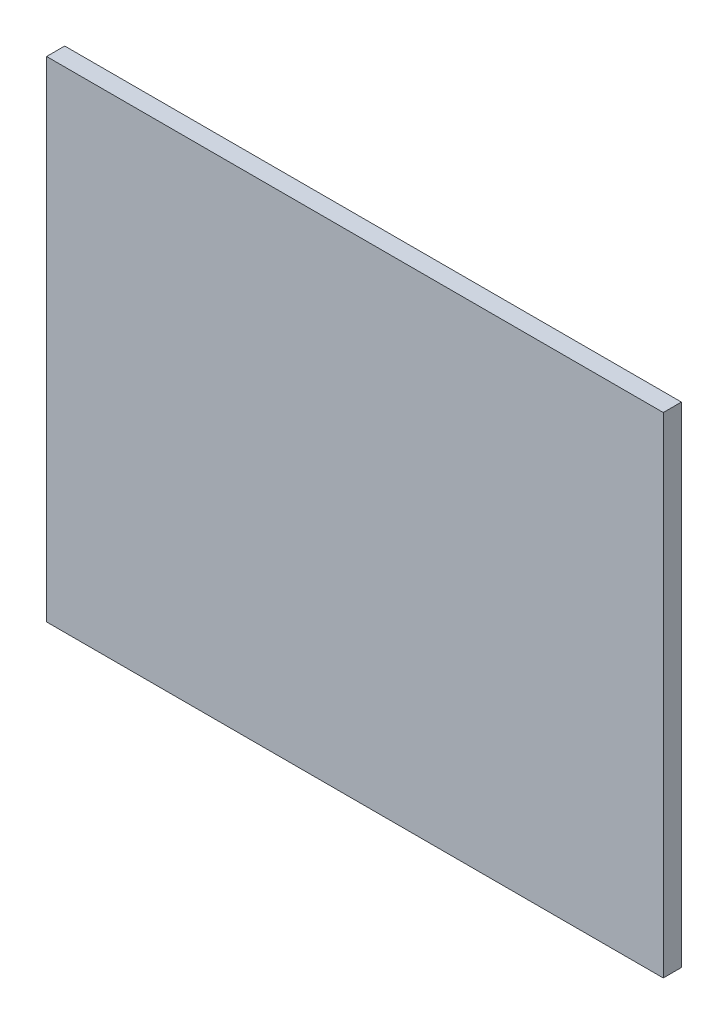
ISO-10303-21;
HEADER;
FILE_DESCRIPTION(('STEP AP214'),'2;1');
FILE_NAME('part.step','',(''),(''),'','','');
FILE_SCHEMA(('AUTOMOTIVE_DESIGN { 1 0 10303 214 1 1 1 1 }'));
ENDSEC;
DATA;
#1=APPLICATION_CONTEXT('core data for automotive mechanical design processes');
#2=APPLICATION_PROTOCOL_DEFINITION('international standard','automotive_design',2000,#1);
#3=PRODUCT_CONTEXT('',#1,'mechanical');
#4=PRODUCT('Part','Part','',(#3));
#5=PRODUCT_RELATED_PRODUCT_CATEGORY('part','',(#4));
#6=PRODUCT_DEFINITION_FORMATION('','',#4);
#7=PRODUCT_DEFINITION_CONTEXT('part definition',#1,'design');
#8=PRODUCT_DEFINITION('design','',#6,#7);
#9=PRODUCT_DEFINITION_SHAPE('','',#8);
#10=(LENGTH_UNIT() NAMED_UNIT(*) SI_UNIT(.MILLI.,.METRE.));
#11=(NAMED_UNIT(*) PLANE_ANGLE_UNIT() SI_UNIT($,.RADIAN.));
#12=(NAMED_UNIT(*) SI_UNIT($,.STERADIAN.) SOLID_ANGLE_UNIT());
#13=UNCERTAINTY_MEASURE_WITH_UNIT(LENGTH_MEASURE(1.E-05),#10,'distance_accuracy_value','');
#14=(GEOMETRIC_REPRESENTATION_CONTEXT(3) GLOBAL_UNCERTAINTY_ASSIGNED_CONTEXT((#13)) GLOBAL_UNIT_ASSIGNED_CONTEXT((#10,
#11,#12)) REPRESENTATION_CONTEXT('',''));
#15=CARTESIAN_POINT('',(0.,0.,0.));
#16=DIRECTION('',(0.,0.,1.));
#17=DIRECTION('',(1.,0.,0.));
#18=AXIS2_PLACEMENT_3D('',#15,#16,#17);
#19=CARTESIAN_POINT('',(340.,270.,10.));
#20=DIRECTION('',(-1.,0.,0.));
#21=DIRECTION('',(0.,-1.,0.));
#22=AXIS2_PLACEMENT_3D('',#19,#20,#21);
#23=PLANE('',#22);
#24=DIRECTION('',(0.,1.,0.));
#25=VECTOR('',#24,1.);
#26=CARTESIAN_POINT('',(340.,270.,0.));
#27=LINE('',#26,#25);
#28=CARTESIAN_POINT('',(340.,0.,0.));
#29=VERTEX_POINT('',#28);
#30=CARTESIAN_POINT('',(340.,270.,0.));
#31=VERTEX_POINT('',#30);
#32=EDGE_CURVE('E96',#29,#31,#27,.T.);
#33=ORIENTED_EDGE('',*,*,#32,.T.);
#34=DIRECTION('',(0.,0.,-1.));
#35=VECTOR('',#34,1.);
#36=CARTESIAN_POINT('',(340.,270.,10.));
#37=LINE('',#36,#35);
#38=CARTESIAN_POINT('',(340.,270.,10.));
#39=VERTEX_POINT('',#38);
#40=EDGE_CURVE('E11',#39,#31,#37,.T.);
#41=ORIENTED_EDGE('',*,*,#40,.F.);
#42=DIRECTION('',(0.,1.,0.));
#43=VECTOR('',#42,1.);
#44=CARTESIAN_POINT('',(340.,270.,10.));
#45=LINE('',#44,#43);
#46=CARTESIAN_POINT('',(340.,0.,10.));
#47=VERTEX_POINT('',#46);
#48=EDGE_CURVE('E84',#47,#39,#45,.T.);
#49=ORIENTED_EDGE('',*,*,#48,.F.);
#50=DIRECTION('',(0.,0.,-1.));
#51=VECTOR('',#50,1.);
#52=CARTESIAN_POINT('',(340.,0.,10.));
#53=LINE('',#52,#51);
#54=EDGE_CURVE('E92',#47,#29,#53,.T.);
#55=ORIENTED_EDGE('',*,*,#54,.T.);
#56=EDGE_LOOP('',(#33,#41,#49,#55));
#57=FACE_BOUND('',#56,.T.);
#58=ADVANCED_FACE('F33',(#57),#23,.F.);
#59=CARTESIAN_POINT('',(340.,270.,10.));
#60=DIRECTION('',(0.,-1.,0.));
#61=DIRECTION('',(1.,0.,0.));
#62=AXIS2_PLACEMENT_3D('',#59,#60,#61);
#63=PLANE('',#62);
#64=DIRECTION('',(-1.,0.,0.));
#65=VECTOR('',#64,1.);
#66=CARTESIAN_POINT('',(340.,270.,0.));
#67=LINE('',#66,#65);
#68=CARTESIAN_POINT('',(2.22044604925031E-13,270.,0.));
#69=VERTEX_POINT('',#68);
#70=EDGE_CURVE('E88',#31,#69,#67,.T.);
#71=ORIENTED_EDGE('',*,*,#70,.T.);
#72=DIRECTION('',(0.,0.,-1.));
#73=VECTOR('',#72,1.);
#74=CARTESIAN_POINT('',(2.22044604925031E-13,270.,10.));
#75=LINE('',#74,#73);
#76=CARTESIAN_POINT('',(2.22044604925031E-13,270.,10.));
#77=VERTEX_POINT('',#76);
#78=EDGE_CURVE('E41',#77,#69,#75,.T.);
#79=ORIENTED_EDGE('',*,*,#78,.F.);
#80=DIRECTION('',(-1.,0.,0.));
#81=VECTOR('',#80,1.);
#82=CARTESIAN_POINT('',(340.,270.,10.));
#83=LINE('',#82,#81);
#84=EDGE_CURVE('E79',#39,#77,#83,.T.);
#85=ORIENTED_EDGE('',*,*,#84,.F.);
#86=ORIENTED_EDGE('',*,*,#40,.T.);
#87=EDGE_LOOP('',(#71,#79,#85,#86));
#88=FACE_BOUND('',#87,.T.);
#89=ADVANCED_FACE('F87',(#88),#63,.F.);
#90=CARTESIAN_POINT('',(2.22044604925031E-13,270.,10.));
#91=DIRECTION('',(1.,0.,0.));
#92=DIRECTION('',(0.,1.,0.));
#93=AXIS2_PLACEMENT_3D('',#90,#91,#92);
#94=PLANE('',#93);
#95=DIRECTION('',(0.,-1.,0.));
#96=VECTOR('',#95,1.);
#97=CARTESIAN_POINT('',(2.22044604925031E-13,270.,0.));
#98=LINE('',#97,#96);
#99=CARTESIAN_POINT('',(0.,0.,0.));
#100=VERTEX_POINT('',#99);
#101=EDGE_CURVE('E66',#69,#100,#98,.T.);
#102=ORIENTED_EDGE('',*,*,#101,.T.);
#103=DIRECTION('',(0.,0.,-1.));
#104=VECTOR('',#103,1.);
#105=CARTESIAN_POINT('',(0.,0.,10.));
#106=LINE('',#105,#104);
#107=CARTESIAN_POINT('',(0.,0.,10.));
#108=VERTEX_POINT('',#107);
#109=EDGE_CURVE('E89',#108,#100,#106,.T.);
#110=ORIENTED_EDGE('',*,*,#109,.F.);
#111=DIRECTION('',(0.,-1.,0.));
#112=VECTOR('',#111,1.);
#113=CARTESIAN_POINT('',(2.22044604925031E-13,270.,10.));
#114=LINE('',#113,#112);
#115=EDGE_CURVE('E82',#77,#108,#114,.T.);
#116=ORIENTED_EDGE('',*,*,#115,.F.);
#117=ORIENTED_EDGE('',*,*,#78,.T.);
#118=EDGE_LOOP('',(#102,#110,#116,#117));
#119=FACE_BOUND('',#118,.T.);
#120=ADVANCED_FACE('F90',(#119),#94,.F.);
#121=CARTESIAN_POINT('',(340.,0.,10.));
#122=DIRECTION('',(0.,1.,0.));
#123=DIRECTION('',(-1.,0.,0.));
#124=AXIS2_PLACEMENT_3D('',#121,#122,#123);
#125=PLANE('',#124);
#126=DIRECTION('',(1.,0.,0.));
#127=VECTOR('',#126,1.);
#128=CARTESIAN_POINT('',(340.,0.,0.));
#129=LINE('',#128,#127);
#130=EDGE_CURVE('E72',#100,#29,#129,.T.);
#131=ORIENTED_EDGE('',*,*,#130,.T.);
#132=ORIENTED_EDGE('',*,*,#54,.F.);
#133=DIRECTION('',(1.,0.,0.));
#134=VECTOR('',#133,1.);
#135=CARTESIAN_POINT('',(340.,0.,10.));
#136=LINE('',#135,#134);
#137=EDGE_CURVE('E49',#108,#47,#136,.T.);
#138=ORIENTED_EDGE('',*,*,#137,.F.);
#139=ORIENTED_EDGE('',*,*,#109,.T.);
#140=EDGE_LOOP('',(#131,#132,#138,#139));
#141=FACE_BOUND('',#140,.T.);
#142=ADVANCED_FACE('F103',(#141),#125,.F.);
#143=CARTESIAN_POINT('',(0.,0.,10.));
#144=DIRECTION('',(0.,0.,-1.));
#145=DIRECTION('',(-1.,0.,0.));
#146=AXIS2_PLACEMENT_3D('',#143,#144,#145);
#147=PLANE('',#146);
#148=ORIENTED_EDGE('',*,*,#48,.T.);
#149=ORIENTED_EDGE('',*,*,#84,.T.);
#150=ORIENTED_EDGE('',*,*,#115,.T.);
#151=ORIENTED_EDGE('',*,*,#137,.T.);
#152=EDGE_LOOP('',(#148,#149,#150,#151));
#153=FACE_BOUND('',#152,.T.);
#154=ADVANCED_FACE('F80',(#153),#147,.F.);
#155=CARTESIAN_POINT('',(0.,0.,0.));
#156=DIRECTION('',(0.,0.,-1.));
#157=DIRECTION('',(-1.,0.,0.));
#158=AXIS2_PLACEMENT_3D('',#155,#156,#157);
#159=PLANE('',#158);
#160=ORIENTED_EDGE('',*,*,#32,.F.);
#161=ORIENTED_EDGE('',*,*,#130,.F.);
#162=ORIENTED_EDGE('',*,*,#101,.F.);
#163=ORIENTED_EDGE('',*,*,#70,.F.);
#164=EDGE_LOOP('',(#160,#161,#162,#163));
#165=FACE_BOUND('',#164,.T.);
#166=ADVANCED_FACE('F106',(#165),#159,.T.);
#167=CLOSED_SHELL('',(#58,#89,#120,#142,#154,#166));
#168=MANIFOLD_SOLID_BREP('B2',#167);
#169=ADVANCED_BREP_SHAPE_REPRESENTATION('',(#18,#168),#14);
#170=SHAPE_DEFINITION_REPRESENTATION(#9,#169);
ENDSEC;
END-ISO-10303-21;
